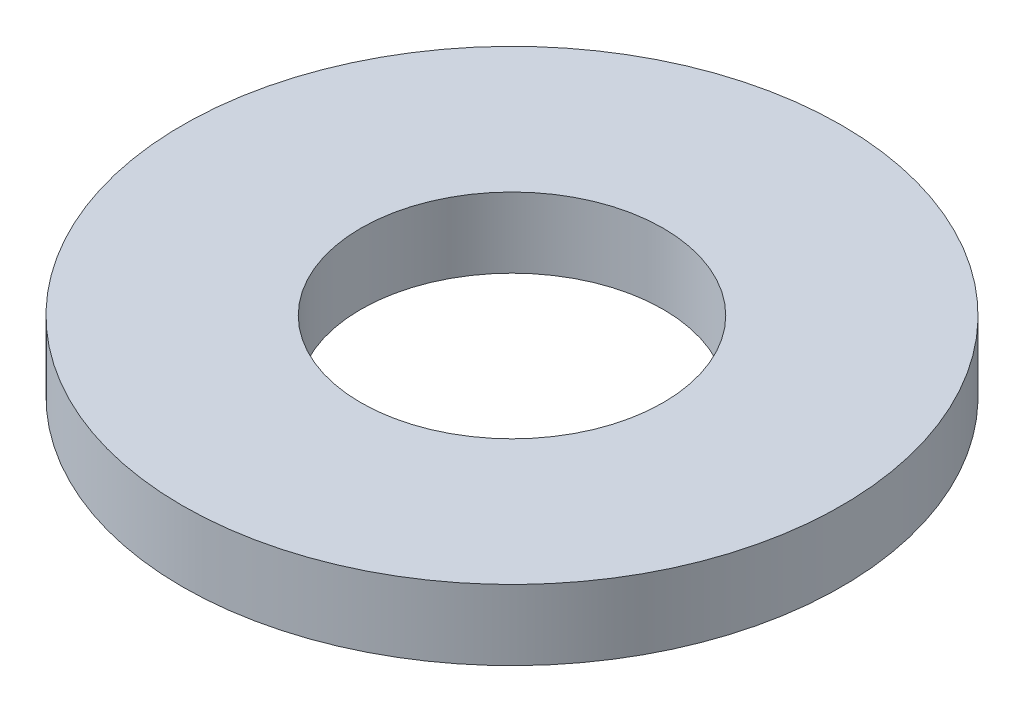
ISO-10303-21;
HEADER;
FILE_DESCRIPTION(('STEP AP214'),'2;1');
FILE_NAME('part.step','',(''),(''),'','','');
FILE_SCHEMA(('AUTOMOTIVE_DESIGN { 1 0 10303 214 1 1 1 1 }'));
ENDSEC;
DATA;
#1=APPLICATION_CONTEXT('core data for automotive mechanical design processes');
#2=APPLICATION_PROTOCOL_DEFINITION('international standard','automotive_design',2000,#1);
#3=PRODUCT_CONTEXT('',#1,'mechanical');
#4=PRODUCT('Part','Part','',(#3));
#5=PRODUCT_RELATED_PRODUCT_CATEGORY('part','',(#4));
#6=PRODUCT_DEFINITION_FORMATION('','',#4);
#7=PRODUCT_DEFINITION_CONTEXT('part definition',#1,'design');
#8=PRODUCT_DEFINITION('design','',#6,#7);
#9=PRODUCT_DEFINITION_SHAPE('','',#8);
#10=(LENGTH_UNIT() NAMED_UNIT(*) SI_UNIT(.MILLI.,.METRE.));
#11=(NAMED_UNIT(*) PLANE_ANGLE_UNIT() SI_UNIT($,.RADIAN.));
#12=(NAMED_UNIT(*) SI_UNIT($,.STERADIAN.) SOLID_ANGLE_UNIT());
#13=UNCERTAINTY_MEASURE_WITH_UNIT(LENGTH_MEASURE(1.E-05),#10,'distance_accuracy_value','');
#14=(GEOMETRIC_REPRESENTATION_CONTEXT(3) GLOBAL_UNCERTAINTY_ASSIGNED_CONTEXT((#13)) GLOBAL_UNIT_ASSIGNED_CONTEXT((#10,
#11,#12)) REPRESENTATION_CONTEXT('',''));
#15=CARTESIAN_POINT('',(0.,0.,0.));
#16=DIRECTION('',(0.,0.,1.));
#17=DIRECTION('',(1.,0.,0.));
#18=AXIS2_PLACEMENT_3D('',#15,#16,#17);
#19=CARTESIAN_POINT('',(0.,1.016,0.));
#20=DIRECTION('',(0.,-1.,0.));
#21=DIRECTION('',(0.,0.,-1.));
#22=AXIS2_PLACEMENT_3D('',#19,#20,#21);
#23=CYLINDRICAL_SURFACE('',#22,4.7625);
#24=CARTESIAN_POINT('',(0.,1.016,0.));
#25=DIRECTION('',(0.,1.,0.));
#26=DIRECTION('',(0.,0.,1.));
#27=AXIS2_PLACEMENT_3D('',#24,#25,#26);
#28=CIRCLE('',#27,4.7625);
#29=CARTESIAN_POINT('',(0.,1.016,4.7625));
#30=VERTEX_POINT('',#29);
#31=EDGE_CURVE('E12',#30,#30,#28,.T.);
#32=ORIENTED_EDGE('',*,*,#31,.F.);
#33=EDGE_LOOP('',(#32));
#34=FACE_BOUND('',#33,.T.);
#35=CARTESIAN_POINT('',(0.,0.,0.));
#36=DIRECTION('',(0.,1.,0.));
#37=DIRECTION('',(0.,0.,1.));
#38=AXIS2_PLACEMENT_3D('',#35,#36,#37);
#39=CIRCLE('',#38,4.7625);
#40=CARTESIAN_POINT('',(0.,0.,4.7625));
#41=VERTEX_POINT('',#40);
#42=EDGE_CURVE('E49',#41,#41,#39,.T.);
#43=ORIENTED_EDGE('',*,*,#42,.T.);
#44=EDGE_LOOP('',(#43));
#45=FACE_BOUND('',#44,.T.);
#46=ADVANCED_FACE('F46',(#34,#45),#23,.T.);
#47=CARTESIAN_POINT('',(0.,1.016,0.));
#48=DIRECTION('',(0.,1.,0.));
#49=DIRECTION('',(0.,0.,1.));
#50=AXIS2_PLACEMENT_3D('',#47,#48,#49);
#51=PLANE('',#50);
#52=CARTESIAN_POINT('',(0.,1.016,0.));
#53=DIRECTION('',(0.,1.,0.));
#54=DIRECTION('',(0.,0.,1.));
#55=AXIS2_PLACEMENT_3D('',#52,#53,#54);
#56=CIRCLE('',#55,2.1844);
#57=CARTESIAN_POINT('',(0.,1.016,2.1844));
#58=VERTEX_POINT('',#57);
#59=EDGE_CURVE('E58',#58,#58,#56,.T.);
#60=ORIENTED_EDGE('',*,*,#59,.F.);
#61=EDGE_LOOP('',(#60));
#62=FACE_BOUND('',#61,.T.);
#63=ORIENTED_EDGE('',*,*,#31,.T.);
#64=EDGE_LOOP('',(#63));
#65=FACE_BOUND('',#64,.T.);
#66=ADVANCED_FACE('F73',(#62,#65),#51,.T.);
#67=CARTESIAN_POINT('',(0.,0.,0.));
#68=DIRECTION('',(0.,1.,0.));
#69=DIRECTION('',(0.,0.,1.));
#70=AXIS2_PLACEMENT_3D('',#67,#68,#69);
#71=PLANE('',#70);
#72=CARTESIAN_POINT('',(0.,0.,0.));
#73=DIRECTION('',(0.,1.,0.));
#74=DIRECTION('',(0.,0.,1.));
#75=AXIS2_PLACEMENT_3D('',#72,#73,#74);
#76=CIRCLE('',#75,2.1844);
#77=CARTESIAN_POINT('',(0.,0.,2.1844));
#78=VERTEX_POINT('',#77);
#79=EDGE_CURVE('E56',#78,#78,#76,.T.);
#80=ORIENTED_EDGE('',*,*,#79,.T.);
#81=EDGE_LOOP('',(#80));
#82=FACE_BOUND('',#81,.T.);
#83=ORIENTED_EDGE('',*,*,#42,.F.);
#84=EDGE_LOOP('',(#83));
#85=FACE_BOUND('',#84,.T.);
#86=ADVANCED_FACE('F64',(#82,#85),#71,.F.);
#87=CARTESIAN_POINT('',(0.,0.,0.));
#88=DIRECTION('',(0.,1.,0.));
#89=DIRECTION('',(0.,0.,1.));
#90=AXIS2_PLACEMENT_3D('',#87,#88,#89);
#91=CYLINDRICAL_SURFACE('',#90,2.1844);
#92=ORIENTED_EDGE('',*,*,#79,.F.);
#93=EDGE_LOOP('',(#92));
#94=FACE_BOUND('',#93,.T.);
#95=ORIENTED_EDGE('',*,*,#59,.T.);
#96=EDGE_LOOP('',(#95));
#97=FACE_BOUND('',#96,.T.);
#98=ADVANCED_FACE('F67',(#94,#97),#91,.F.);
#99=CLOSED_SHELL('',(#46,#66,#86,#98));
#100=MANIFOLD_SOLID_BREP('B2',#99);
#101=ADVANCED_BREP_SHAPE_REPRESENTATION('',(#18,#100),#14);
#102=SHAPE_DEFINITION_REPRESENTATION(#9,#101);
ENDSEC;
END-ISO-10303-21;
